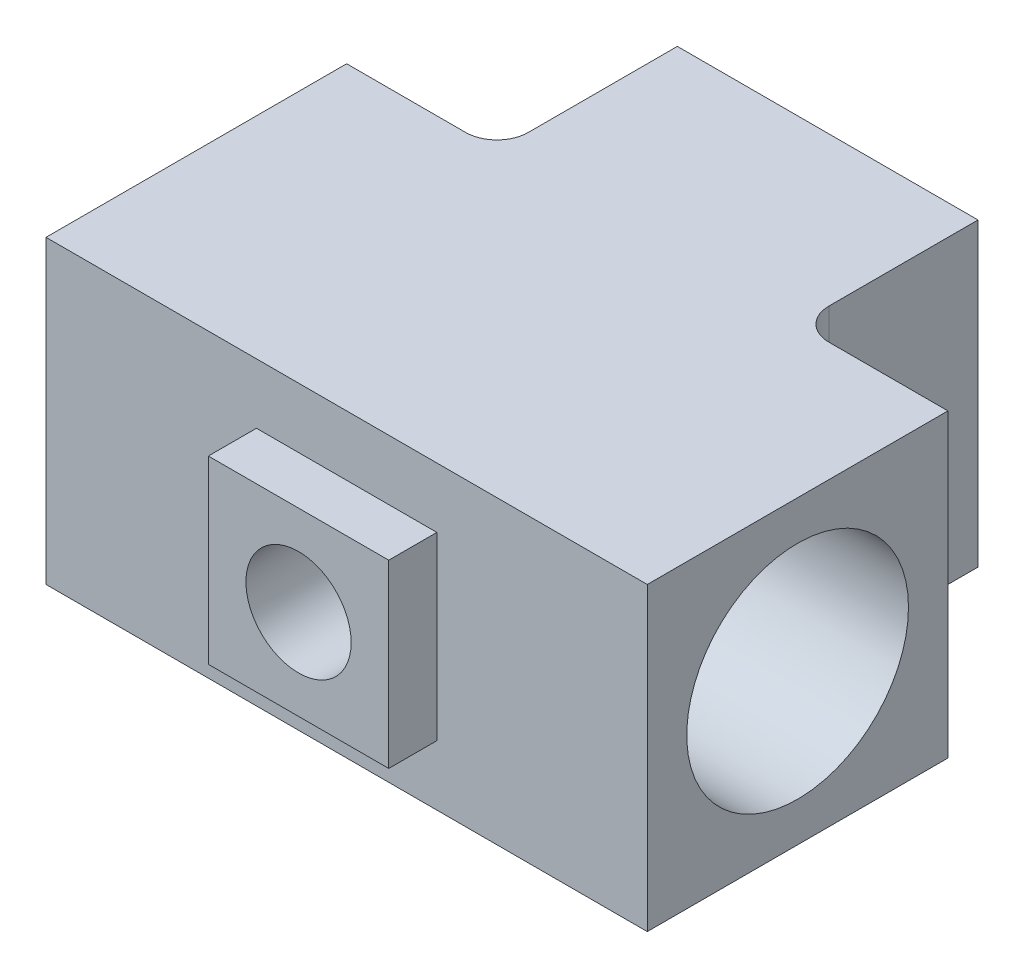
ISO-10303-21;
HEADER;
FILE_DESCRIPTION(('STEP AP214'),'2;1');
FILE_NAME('part.step','',(''),(''),'','','');
FILE_SCHEMA(('AUTOMOTIVE_DESIGN { 1 0 10303 214 1 1 1 1 }'));
ENDSEC;
DATA;
#1=APPLICATION_CONTEXT('core data for automotive mechanical design processes');
#2=APPLICATION_PROTOCOL_DEFINITION('international standard','automotive_design',2000,#1);
#3=PRODUCT_CONTEXT('',#1,'mechanical');
#4=PRODUCT('Part','Part','',(#3));
#5=PRODUCT_RELATED_PRODUCT_CATEGORY('part','',(#4));
#6=PRODUCT_DEFINITION_FORMATION('','',#4);
#7=PRODUCT_DEFINITION_CONTEXT('part definition',#1,'design');
#8=PRODUCT_DEFINITION('design','',#6,#7);
#9=PRODUCT_DEFINITION_SHAPE('','',#8);
#10=(LENGTH_UNIT() NAMED_UNIT(*) SI_UNIT(.MILLI.,.METRE.));
#11=(NAMED_UNIT(*) PLANE_ANGLE_UNIT() SI_UNIT($,.RADIAN.));
#12=(NAMED_UNIT(*) SI_UNIT($,.STERADIAN.) SOLID_ANGLE_UNIT());
#13=UNCERTAINTY_MEASURE_WITH_UNIT(LENGTH_MEASURE(1.E-05),#10,'distance_accuracy_value','');
#14=(GEOMETRIC_REPRESENTATION_CONTEXT(3) GLOBAL_UNCERTAINTY_ASSIGNED_CONTEXT((#13)) GLOBAL_UNIT_ASSIGNED_CONTEXT((#10,
#11,#12)) REPRESENTATION_CONTEXT('',''));
#15=CARTESIAN_POINT('',(0.,0.,0.));
#16=DIRECTION('',(0.,0.,1.));
#17=DIRECTION('',(1.,0.,0.));
#18=AXIS2_PLACEMENT_3D('',#15,#16,#17);
#19=CARTESIAN_POINT('',(0.,31.75,15.875));
#20=DIRECTION('',(0.,0.,-1.));
#21=DIRECTION('',(-1.,0.,0.));
#22=AXIS2_PLACEMENT_3D('',#19,#20,#21);
#23=PLANE('',#22);
#24=DIRECTION('',(1.,0.,0.));
#25=VECTOR('',#24,1.);
#26=CARTESIAN_POINT('',(0.,0.,15.875));
#27=LINE('',#26,#25);
#28=CARTESIAN_POINT('',(-31.75,0.,15.875));
#29=VERTEX_POINT('',#28);
#30=CARTESIAN_POINT('',(31.75,0.,15.875));
#31=VERTEX_POINT('',#30);
#32=EDGE_CURVE('E206',#29,#31,#27,.T.);
#33=ORIENTED_EDGE('',*,*,#32,.T.);
#34=DIRECTION('',(0.,-1.,0.));
#35=VECTOR('',#34,1.);
#36=CARTESIAN_POINT('',(31.75,31.75,15.875));
#37=LINE('',#36,#35);
#38=CARTESIAN_POINT('',(31.75,31.75,15.875));
#39=VERTEX_POINT('',#38);
#40=EDGE_CURVE('E276',#39,#31,#37,.T.);
#41=ORIENTED_EDGE('',*,*,#40,.F.);
#42=DIRECTION('',(1.,0.,0.));
#43=VECTOR('',#42,1.);
#44=CARTESIAN_POINT('',(0.,31.75,15.875));
#45=LINE('',#44,#43);
#46=CARTESIAN_POINT('',(-31.75,31.75,15.875));
#47=VERTEX_POINT('',#46);
#48=EDGE_CURVE('E207',#47,#39,#45,.T.);
#49=ORIENTED_EDGE('',*,*,#48,.F.);
#50=DIRECTION('',(0.,-1.,0.));
#51=VECTOR('',#50,1.);
#52=CARTESIAN_POINT('',(-31.75,31.75,15.875));
#53=LINE('',#52,#51);
#54=EDGE_CURVE('E234',#47,#29,#53,.T.);
#55=ORIENTED_EDGE('',*,*,#54,.T.);
#56=EDGE_LOOP('',(#33,#41,#49,#55));
#57=FACE_BOUND('',#56,.T.);
#58=DIRECTION('',(1.,0.,0.));
#59=VECTOR('',#58,1.);
#60=CARTESIAN_POINT('',(0.,6.35,15.875));
#61=LINE('',#60,#59);
#62=CARTESIAN_POINT('',(-9.525,6.35,15.875));
#63=VERTEX_POINT('',#62);
#64=CARTESIAN_POINT('',(9.525,6.35,15.875));
#65=VERTEX_POINT('',#64);
#66=EDGE_CURVE('E182',#63,#65,#61,.T.);
#67=ORIENTED_EDGE('',*,*,#66,.F.);
#68=DIRECTION('',(0.,1.,0.));
#69=VECTOR('',#68,1.);
#70=CARTESIAN_POINT('',(-9.525,0.,15.875));
#71=LINE('',#70,#69);
#72=CARTESIAN_POINT('',(-9.525,25.4,15.875));
#73=VERTEX_POINT('',#72);
#74=EDGE_CURVE('E179',#63,#73,#71,.T.);
#75=ORIENTED_EDGE('',*,*,#74,.T.);
#76=DIRECTION('',(1.,0.,0.));
#77=VECTOR('',#76,1.);
#78=CARTESIAN_POINT('',(0.,25.4,15.875));
#79=LINE('',#78,#77);
#80=CARTESIAN_POINT('',(9.525,25.4,15.875));
#81=VERTEX_POINT('',#80);
#82=EDGE_CURVE('E603',#73,#81,#79,.T.);
#83=ORIENTED_EDGE('',*,*,#82,.T.);
#84=DIRECTION('',(0.,1.,0.));
#85=VECTOR('',#84,1.);
#86=CARTESIAN_POINT('',(9.525,0.,15.875));
#87=LINE('',#86,#85);
#88=EDGE_CURVE('E595',#65,#81,#87,.T.);
#89=ORIENTED_EDGE('',*,*,#88,.F.);
#90=EDGE_LOOP('',(#67,#75,#83,#89));
#91=FACE_BOUND('',#90,.T.);
#92=ADVANCED_FACE('F43',(#57,#91),#23,.F.);
#93=CARTESIAN_POINT('',(31.75,31.75,0.));
#94=DIRECTION('',(-1.,0.,0.));
#95=DIRECTION('',(0.,0.,1.));
#96=AXIS2_PLACEMENT_3D('',#93,#94,#95);
#97=PLANE('',#96);
#98=CARTESIAN_POINT('',(31.75,15.875,0.));
#99=DIRECTION('',(1.,0.,0.));
#100=DIRECTION('',(0.,0.,-1.));
#101=AXIS2_PLACEMENT_3D('',#98,#99,#100);
#102=CIRCLE('',#101,11.707876);
#103=CARTESIAN_POINT('',(31.75,15.875,-11.707876));
#104=VERTEX_POINT('',#103);
#105=EDGE_CURVE('E198',#104,#104,#102,.T.);
#106=ORIENTED_EDGE('',*,*,#105,.F.);
#107=EDGE_LOOP('',(#106));
#108=FACE_BOUND('',#107,.T.);
#109=DIRECTION('',(0.,0.,-1.));
#110=VECTOR('',#109,1.);
#111=CARTESIAN_POINT('',(31.75,0.,0.));
#112=LINE('',#111,#110);
#113=CARTESIAN_POINT('',(31.75,0.,-15.875));
#114=VERTEX_POINT('',#113);
#115=EDGE_CURVE('E238',#31,#114,#112,.T.);
#116=ORIENTED_EDGE('',*,*,#115,.T.);
#117=DIRECTION('',(0.,-1.,0.));
#118=VECTOR('',#117,1.);
#119=CARTESIAN_POINT('',(31.75,31.75,-15.875));
#120=LINE('',#119,#118);
#121=CARTESIAN_POINT('',(31.75,31.75,-15.875));
#122=VERTEX_POINT('',#121);
#123=EDGE_CURVE('E272',#122,#114,#120,.T.);
#124=ORIENTED_EDGE('',*,*,#123,.F.);
#125=DIRECTION('',(0.,0.,-1.));
#126=VECTOR('',#125,1.);
#127=CARTESIAN_POINT('',(31.75,31.75,0.));
#128=LINE('',#127,#126);
#129=EDGE_CURVE('E211',#39,#122,#128,.T.);
#130=ORIENTED_EDGE('',*,*,#129,.F.);
#131=ORIENTED_EDGE('',*,*,#40,.T.);
#132=EDGE_LOOP('',(#116,#124,#130,#131));
#133=FACE_BOUND('',#132,.T.);
#134=ADVANCED_FACE('F349',(#108,#133),#97,.F.);
#135=CARTESIAN_POINT('',(0.,31.75,-15.875));
#136=DIRECTION('',(0.,0.,-1.));
#137=DIRECTION('',(-1.,0.,0.));
#138=AXIS2_PLACEMENT_3D('',#135,#136,#137);
#139=PLANE('',#138);
#140=DIRECTION('',(1.,0.,0.));
#141=VECTOR('',#140,1.);
#142=CARTESIAN_POINT('',(0.,0.,-15.875));
#143=LINE('',#142,#141);
#144=CARTESIAN_POINT('',(19.177,0.,-15.875));
#145=VERTEX_POINT('',#144);
#146=EDGE_CURVE('E242',#145,#114,#143,.T.);
#147=ORIENTED_EDGE('',*,*,#146,.F.);
#148=DIRECTION('',(0.,-1.,0.));
#149=VECTOR('',#148,1.);
#150=CARTESIAN_POINT('',(19.177,31.75,-15.875));
#151=LINE('',#150,#149);
#152=CARTESIAN_POINT('',(19.177,31.75,-15.875));
#153=VERTEX_POINT('',#152);
#154=EDGE_CURVE('E370',#145,#153,#151,.F.);
#155=ORIENTED_EDGE('',*,*,#154,.T.);
#156=DIRECTION('',(1.,0.,0.));
#157=VECTOR('',#156,1.);
#158=CARTESIAN_POINT('',(0.,31.75,-15.875));
#159=LINE('',#158,#157);
#160=EDGE_CURVE('E216',#153,#122,#159,.T.);
#161=ORIENTED_EDGE('',*,*,#160,.T.);
#162=ORIENTED_EDGE('',*,*,#123,.T.);
#163=EDGE_LOOP('',(#147,#155,#161,#162));
#164=FACE_BOUND('',#163,.T.);
#165=ADVANCED_FACE('F355',(#164),#139,.T.);
#166=CARTESIAN_POINT('',(15.875,31.75,0.));
#167=DIRECTION('',(-1.,0.,0.));
#168=DIRECTION('',(0.,0.,1.));
#169=AXIS2_PLACEMENT_3D('',#166,#167,#168);
#170=PLANE('',#169);
#171=DIRECTION('',(0.,0.,-1.));
#172=VECTOR('',#171,1.);
#173=CARTESIAN_POINT('',(15.875,31.75,0.));
#174=LINE('',#173,#172);
#175=CARTESIAN_POINT('',(15.875,31.75,-19.177));
#176=VERTEX_POINT('',#175);
#177=CARTESIAN_POINT('',(15.875,31.75,-34.925));
#178=VERTEX_POINT('',#177);
#179=EDGE_CURVE('E219',#176,#178,#174,.T.);
#180=ORIENTED_EDGE('',*,*,#179,.F.);
#181=DIRECTION('',(0.,-1.,0.));
#182=VECTOR('',#181,1.);
#183=CARTESIAN_POINT('',(15.875,31.75,-19.177));
#184=LINE('',#183,#182);
#185=CARTESIAN_POINT('',(15.875,0.,-19.177));
#186=VERTEX_POINT('',#185);
#187=EDGE_CURVE('E313',#176,#186,#184,.T.);
#188=ORIENTED_EDGE('',*,*,#187,.T.);
#189=DIRECTION('',(0.,0.,-1.));
#190=VECTOR('',#189,1.);
#191=CARTESIAN_POINT('',(15.875,0.,0.));
#192=LINE('',#191,#190);
#193=CARTESIAN_POINT('',(15.875,0.,-34.925));
#194=VERTEX_POINT('',#193);
#195=EDGE_CURVE('E245',#186,#194,#192,.T.);
#196=ORIENTED_EDGE('',*,*,#195,.T.);
#197=DIRECTION('',(0.,-1.,0.));
#198=VECTOR('',#197,1.);
#199=CARTESIAN_POINT('',(15.875,31.75,-34.925));
#200=LINE('',#199,#198);
#201=EDGE_CURVE('E268',#178,#194,#200,.T.);
#202=ORIENTED_EDGE('',*,*,#201,.F.);
#203=EDGE_LOOP('',(#180,#188,#196,#202));
#204=FACE_BOUND('',#203,.T.);
#205=ADVANCED_FACE('F393',(#204),#170,.F.);
#206=CARTESIAN_POINT('',(0.,31.75,-34.925));
#207=DIRECTION('',(0.,0.,-1.));
#208=DIRECTION('',(-1.,0.,0.));
#209=AXIS2_PLACEMENT_3D('',#206,#207,#208);
#210=PLANE('',#209);
#211=CARTESIAN_POINT('',(0.,15.875,-34.925));
#212=DIRECTION('',(0.,0.,-1.));
#213=DIRECTION('',(-1.,0.,0.));
#214=AXIS2_PLACEMENT_3D('',#211,#212,#213);
#215=CIRCLE('',#214,11.707876);
#216=CARTESIAN_POINT('',(-11.707876,15.875,-34.925));
#217=VERTEX_POINT('',#216);
#218=EDGE_CURVE('E184',#217,#217,#215,.T.);
#219=ORIENTED_EDGE('',*,*,#218,.F.);
#220=EDGE_LOOP('',(#219));
#221=FACE_BOUND('',#220,.T.);
#222=DIRECTION('',(1.,0.,0.));
#223=VECTOR('',#222,1.);
#224=CARTESIAN_POINT('',(0.,0.,-34.925));
#225=LINE('',#224,#223);
#226=CARTESIAN_POINT('',(-15.875,0.,-34.925));
#227=VERTEX_POINT('',#226);
#228=EDGE_CURVE('E249',#227,#194,#225,.T.);
#229=ORIENTED_EDGE('',*,*,#228,.F.);
#230=DIRECTION('',(0.,-1.,0.));
#231=VECTOR('',#230,1.);
#232=CARTESIAN_POINT('',(-15.875,31.75,-34.925));
#233=LINE('',#232,#231);
#234=CARTESIAN_POINT('',(-15.875,31.75,-34.925));
#235=VERTEX_POINT('',#234);
#236=EDGE_CURVE('E264',#235,#227,#233,.T.);
#237=ORIENTED_EDGE('',*,*,#236,.F.);
#238=DIRECTION('',(1.,0.,0.));
#239=VECTOR('',#238,1.);
#240=CARTESIAN_POINT('',(0.,31.75,-34.925));
#241=LINE('',#240,#239);
#242=EDGE_CURVE('E223',#235,#178,#241,.T.);
#243=ORIENTED_EDGE('',*,*,#242,.T.);
#244=ORIENTED_EDGE('',*,*,#201,.T.);
#245=EDGE_LOOP('',(#229,#237,#243,#244));
#246=FACE_BOUND('',#245,.T.);
#247=ADVANCED_FACE('F400',(#221,#246),#210,.T.);
#248=CARTESIAN_POINT('',(-15.875,31.75,0.));
#249=DIRECTION('',(-1.,0.,0.));
#250=DIRECTION('',(0.,0.,1.));
#251=AXIS2_PLACEMENT_3D('',#248,#249,#250);
#252=PLANE('',#251);
#253=DIRECTION('',(0.,0.,-1.));
#254=VECTOR('',#253,1.);
#255=CARTESIAN_POINT('',(-15.875,0.,0.));
#256=LINE('',#255,#254);
#257=CARTESIAN_POINT('',(-15.875,0.,-19.177));
#258=VERTEX_POINT('',#257);
#259=EDGE_CURVE('E253',#258,#227,#256,.T.);
#260=ORIENTED_EDGE('',*,*,#259,.F.);
#261=DIRECTION('',(0.,-1.,0.));
#262=VECTOR('',#261,1.);
#263=CARTESIAN_POINT('',(-15.875,31.75,-19.177));
#264=LINE('',#263,#262);
#265=CARTESIAN_POINT('',(-15.875,31.75,-19.177));
#266=VERTEX_POINT('',#265);
#267=EDGE_CURVE('E59',#258,#266,#264,.F.);
#268=ORIENTED_EDGE('',*,*,#267,.T.);
#269=DIRECTION('',(0.,0.,-1.));
#270=VECTOR('',#269,1.);
#271=CARTESIAN_POINT('',(-15.875,31.75,0.));
#272=LINE('',#271,#270);
#273=EDGE_CURVE('E227',#266,#235,#272,.T.);
#274=ORIENTED_EDGE('',*,*,#273,.T.);
#275=ORIENTED_EDGE('',*,*,#236,.T.);
#276=EDGE_LOOP('',(#260,#268,#274,#275));
#277=FACE_BOUND('',#276,.T.);
#278=ADVANCED_FACE('F434',(#277),#252,.T.);
#279=CARTESIAN_POINT('',(-31.75,31.75,-15.875));
#280=VERTEX_POINT('',#279);
#281=CARTESIAN_POINT('',(-19.177,31.75,-15.875));
#282=VERTEX_POINT('',#281);
#283=EDGE_CURVE('E220',#280,#282,#159,.T.);
#284=ORIENTED_EDGE('',*,*,#283,.T.);
#285=DIRECTION('',(0.,-1.,0.));
#286=VECTOR('',#285,1.);
#287=CARTESIAN_POINT('',(-19.177,0.,-15.875));
#288=LINE('',#287,#286);
#289=CARTESIAN_POINT('',(-19.177,0.,-15.875));
#290=VERTEX_POINT('',#289);
#291=EDGE_CURVE('E384',#282,#290,#288,.T.);
#292=ORIENTED_EDGE('',*,*,#291,.T.);
#293=CARTESIAN_POINT('',(-31.75,0.,-15.875));
#294=VERTEX_POINT('',#293);
#295=EDGE_CURVE('E246',#294,#290,#143,.T.);
#296=ORIENTED_EDGE('',*,*,#295,.F.);
#297=DIRECTION('',(0.,-1.,0.));
#298=VECTOR('',#297,1.);
#299=CARTESIAN_POINT('',(-31.75,31.75,-15.875));
#300=LINE('',#299,#298);
#301=EDGE_CURVE('E261',#280,#294,#300,.T.);
#302=ORIENTED_EDGE('',*,*,#301,.F.);
#303=EDGE_LOOP('',(#284,#292,#296,#302));
#304=FACE_BOUND('',#303,.T.);
#305=ADVANCED_FACE('F409',(#304),#139,.T.);
#306=CARTESIAN_POINT('',(-31.75,31.75,0.));
#307=DIRECTION('',(-1.,0.,0.));
#308=DIRECTION('',(0.,0.,1.));
#309=AXIS2_PLACEMENT_3D('',#306,#307,#308);
#310=PLANE('',#309);
#311=CARTESIAN_POINT('',(-31.75,15.875,0.));
#312=DIRECTION('',(1.,0.,0.));
#313=DIRECTION('',(0.,0.,-1.));
#314=AXIS2_PLACEMENT_3D('',#311,#312,#313);
#315=CIRCLE('',#314,11.707876);
#316=CARTESIAN_POINT('',(-31.75,15.875,-11.707876));
#317=VERTEX_POINT('',#316);
#318=EDGE_CURVE('E202',#317,#317,#315,.T.);
#319=ORIENTED_EDGE('',*,*,#318,.T.);
#320=EDGE_LOOP('',(#319));
#321=FACE_BOUND('',#320,.T.);
#322=DIRECTION('',(0.,0.,-1.));
#323=VECTOR('',#322,1.);
#324=CARTESIAN_POINT('',(-31.75,0.,0.));
#325=LINE('',#324,#323);
#326=EDGE_CURVE('E212',#29,#294,#325,.T.);
#327=ORIENTED_EDGE('',*,*,#326,.F.);
#328=ORIENTED_EDGE('',*,*,#54,.F.);
#329=DIRECTION('',(0.,0.,-1.));
#330=VECTOR('',#329,1.);
#331=CARTESIAN_POINT('',(-31.75,31.75,0.));
#332=LINE('',#331,#330);
#333=EDGE_CURVE('E230',#47,#280,#332,.T.);
#334=ORIENTED_EDGE('',*,*,#333,.T.);
#335=ORIENTED_EDGE('',*,*,#301,.T.);
#336=EDGE_LOOP('',(#327,#328,#334,#335));
#337=FACE_BOUND('',#336,.T.);
#338=ADVANCED_FACE('F444',(#321,#337),#310,.T.);
#339=CARTESIAN_POINT('',(0.,31.75,0.));
#340=DIRECTION('',(0.,1.,0.));
#341=DIRECTION('',(0.,0.,1.));
#342=AXIS2_PLACEMENT_3D('',#339,#340,#341);
#343=PLANE('',#342);
#344=ORIENTED_EDGE('',*,*,#48,.T.);
#345=ORIENTED_EDGE('',*,*,#129,.T.);
#346=ORIENTED_EDGE('',*,*,#160,.F.);
#347=CARTESIAN_POINT('',(19.177,31.75,-19.177));
#348=DIRECTION('',(0.,1.,0.));
#349=DIRECTION('',(0.,0.,1.));
#350=AXIS2_PLACEMENT_3D('',#347,#348,#349);
#351=CIRCLE('',#350,3.302);
#352=EDGE_CURVE('E369',#153,#176,#351,.F.);
#353=ORIENTED_EDGE('',*,*,#352,.T.);
#354=ORIENTED_EDGE('',*,*,#179,.T.);
#355=ORIENTED_EDGE('',*,*,#242,.F.);
#356=ORIENTED_EDGE('',*,*,#273,.F.);
#357=CARTESIAN_POINT('',(-19.177,31.75,-19.177));
#358=DIRECTION('',(0.,1.,0.));
#359=DIRECTION('',(0.,0.,1.));
#360=AXIS2_PLACEMENT_3D('',#357,#358,#359);
#361=CIRCLE('',#360,3.302);
#362=EDGE_CURVE('E11',#266,#282,#361,.F.);
#363=ORIENTED_EDGE('',*,*,#362,.T.);
#364=ORIENTED_EDGE('',*,*,#283,.F.);
#365=ORIENTED_EDGE('',*,*,#333,.F.);
#366=EDGE_LOOP('',(#344,#345,#346,#353,#354,#355,#356,#363,#364,#365));
#367=FACE_BOUND('',#366,.T.);
#368=ADVANCED_FACE('F402',(#367),#343,.T.);
#369=CARTESIAN_POINT('',(0.,0.,0.));
#370=DIRECTION('',(0.,1.,0.));
#371=DIRECTION('',(0.,0.,1.));
#372=AXIS2_PLACEMENT_3D('',#369,#370,#371);
#373=PLANE('',#372);
#374=ORIENTED_EDGE('',*,*,#32,.F.);
#375=ORIENTED_EDGE('',*,*,#326,.T.);
#376=ORIENTED_EDGE('',*,*,#295,.T.);
#377=CARTESIAN_POINT('',(-19.177,0.,-19.177));
#378=DIRECTION('',(0.,1.,0.));
#379=DIRECTION('',(0.,0.,1.));
#380=AXIS2_PLACEMENT_3D('',#377,#378,#379);
#381=CIRCLE('',#380,3.302);
#382=EDGE_CURVE('E52',#290,#258,#381,.T.);
#383=ORIENTED_EDGE('',*,*,#382,.T.);
#384=ORIENTED_EDGE('',*,*,#259,.T.);
#385=ORIENTED_EDGE('',*,*,#228,.T.);
#386=ORIENTED_EDGE('',*,*,#195,.F.);
#387=CARTESIAN_POINT('',(19.177,0.,-19.177));
#388=DIRECTION('',(0.,1.,0.));
#389=DIRECTION('',(0.,0.,1.));
#390=AXIS2_PLACEMENT_3D('',#387,#388,#389);
#391=CIRCLE('',#390,3.302);
#392=EDGE_CURVE('E376',#186,#145,#391,.T.);
#393=ORIENTED_EDGE('',*,*,#392,.T.);
#394=ORIENTED_EDGE('',*,*,#146,.T.);
#395=ORIENTED_EDGE('',*,*,#115,.F.);
#396=EDGE_LOOP('',(#374,#375,#376,#383,#384,#385,#386,#393,#394,#395));
#397=FACE_BOUND('',#396,.T.);
#398=ADVANCED_FACE('F396',(#397),#373,.F.);
#399=CARTESIAN_POINT('',(31.75,15.875,0.));
#400=DIRECTION('',(1.,0.,0.));
#401=DIRECTION('',(0.,0.,-1.));
#402=AXIS2_PLACEMENT_3D('',#399,#400,#401);
#403=CYLINDRICAL_SURFACE('',#402,11.707876);
#404=CARTESIAN_POINT('',(5.55625,15.875,11.707876));
#405=CARTESIAN_POINT('',(5.5562490670547,16.0219956300197,11.7078751881534));
#406=CARTESIAN_POINT('',(5.55040944138286,16.1690144828683,11.7051007412646));
#407=CARTESIAN_POINT('',(5.52711300941749,16.461980757862,11.6940720886933));
#408=CARTESIAN_POINT('',(5.5096503982511,16.6079276077738,11.6858151448901));
#409=CARTESIAN_POINT('',(5.46326853428186,16.8978361602466,11.6640185894263));
#410=CARTESIAN_POINT('',(5.43433046697483,17.0417941989339,11.6504703029361));
#411=CARTESIAN_POINT('',(5.36530691071274,17.3265046320242,11.6184349778542));
#412=CARTESIAN_POINT('',(5.3252168641208,17.4672556902865,11.5999459201696));
#413=CARTESIAN_POINT('',(5.23449222101402,17.7439869649946,11.558578243056));
#414=CARTESIAN_POINT('',(5.18390260396629,17.8799847312361,11.5357183797388));
#415=CARTESIAN_POINT('',(5.07254787724768,18.1470328976869,11.4861095658599));
#416=CARTESIAN_POINT('',(5.01177894652446,18.2780814173543,11.4593591553855));
#417=CARTESIAN_POINT('',(4.81500573588385,18.6625356387209,11.374210817044));
#418=CARTESIAN_POINT('',(4.66442750006194,18.9075748322604,11.3108650175544));
#419=CARTESIAN_POINT('',(4.31931225020357,19.3830943690822,11.172846650347));
#420=CARTESIAN_POINT('',(4.12278313903047,19.6119869093358,11.0977380273396));
#421=CARTESIAN_POINT('',(3.69536606488713,20.0351137703647,10.9461555166101));
#422=CARTESIAN_POINT('',(3.46445486769873,20.2293244576388,10.8696807366803));
#423=CARTESIAN_POINT('',(3.08761306739184,20.4971802127023,10.7573275120701));
#424=CARTESIAN_POINT('',(2.95214301803387,20.5848729763442,10.7191187675812));
#425=CARTESIAN_POINT('',(2.67348841892434,20.7484420665901,10.6457475911625));
#426=CARTESIAN_POINT('',(2.53030715440833,20.8243233725001,10.6105838783407));
#427=CARTESIAN_POINT('',(2.23705973706034,20.9635981838658,10.5444999682807));
#428=CARTESIAN_POINT('',(2.08699382639768,21.0269921281533,10.5135796219335));
#429=CARTESIAN_POINT('',(1.78104248589405,21.1405868303316,10.4571497495938));
#430=CARTESIAN_POINT('',(1.62516040846482,21.190795058236,10.4316371615681));
#431=CARTESIAN_POINT('',(1.31763187169123,21.2749744066381,10.3882988077653));
#432=CARTESIAN_POINT('',(1.16624211207503,21.3097013787946,10.3701207556261));
#433=CARTESIAN_POINT('',(0.860534032998205,21.366406561334,10.3402053407049));
#434=CARTESIAN_POINT('',(0.706217237467131,21.3883912273824,10.3284647166761));
#435=CARTESIAN_POINT('',(0.395983551960721,21.4193124074155,10.3118994285777));
#436=CARTESIAN_POINT('',(0.240067452818413,21.4282550842524,10.3070714980085));
#437=CARTESIAN_POINT('',(-0.0720160121535494,21.4329741440577,10.3045278279577));
#438=CARTESIAN_POINT('',(-0.228183356988383,21.4287515752965,10.3068115222195));
#439=CARTESIAN_POINT('',(-0.522928915415686,21.408347008689,10.3177779419443));
#440=CARTESIAN_POINT('',(-0.661626198136956,21.3934723912927,10.3257608677416));
#441=CARTESIAN_POINT('',(-0.937151103292585,21.3534165957299,10.3470685065718));
#442=CARTESIAN_POINT('',(-1.07397811602019,21.3282321356429,10.3603949205636));
#443=CARTESIAN_POINT('',(-1.34479800167592,21.2678352781495,10.3919606898642));
#444=CARTESIAN_POINT('',(-1.47879133751689,21.2326245324577,10.4101992359292));
#445=CARTESIAN_POINT('',(-1.74319244552311,21.1525283471567,10.451031910625));
#446=CARTESIAN_POINT('',(-1.87359879519847,21.1076391299959,10.4736277395583));
#447=CARTESIAN_POINT('',(-2.26419153088437,20.9567618925136,10.5481218915923));
#448=CARTESIAN_POINT('',(-2.51768397132441,20.8359244835259,10.6059777720465));
#449=CARTESIAN_POINT('',(-3.00181689912236,20.5589065955817,10.7311887482533));
#450=CARTESIAN_POINT('',(-3.23244723761796,20.4027105204648,10.7985480308548));
#451=CARTESIAN_POINT('',(-3.69183766517802,20.0388318111672,10.9443811212133));
#452=CARTESIAN_POINT('',(-3.91745591328223,19.8273300013133,11.0232518530874));
#453=CARTESIAN_POINT('',(-4.33132042570187,19.3688331100084,11.1770205898922));
#454=CARTESIAN_POINT('',(-4.51955208699981,19.121824224347,11.2519170341479));
#455=CARTESIAN_POINT('',(-4.77304693768573,18.7238633432388,11.3568591982738));
#456=CARTESIAN_POINT('',(-4.85394463688191,18.5837680812418,11.3911669215658));
#457=CARTESIAN_POINT('',(-5.00352831891484,18.2963277467566,11.4557050429006));
#458=CARTESIAN_POINT('',(-5.07221939836861,18.1489857329613,11.4859371413561));
#459=CARTESIAN_POINT('',(-5.19666325541256,17.8480962418706,11.5414321496642));
#460=CARTESIAN_POINT('',(-5.2524205517506,17.6945509539284,11.5666967945522));
#461=CARTESIAN_POINT('',(-5.35037081659372,17.3823802824512,11.6115035298262));
#462=CARTESIAN_POINT('',(-5.39256517116058,17.2237554198453,11.6310462049495));
#463=CARTESIAN_POINT('',(-5.46012906456972,16.915144658783,11.662531266347));
#464=CARTESIAN_POINT('',(-5.48654457741583,16.7654350163584,11.6749432879645));
#465=CARTESIAN_POINT('',(-5.52703502689974,16.4639974931509,11.6940259057448));
#466=CARTESIAN_POINT('',(-5.5411109121972,16.312269768427,11.7006969432686));
#467=CARTESIAN_POINT('',(-5.55674296594966,16.0080771010916,11.7081079424604));
#468=CARTESIAN_POINT('',(-5.55830329883384,15.8556124205924,11.7088498769798));
#469=CARTESIAN_POINT('',(-5.54889489263416,15.5511608531681,11.704386489232));
#470=CARTESIAN_POINT('',(-5.53792660674304,15.39917394916,11.6991813820847));
#471=CARTESIAN_POINT('',(-5.50478017063363,15.1072862469522,11.6835292579519));
#472=CARTESIAN_POINT('',(-5.48342146609895,14.9672707825598,11.6734657841895));
#473=CARTESIAN_POINT('',(-5.43017825708567,14.6896460047093,11.6485505178758));
#474=CARTESIAN_POINT('',(-5.39829038796472,14.5520374752185,11.6336971947419));
#475=CARTESIAN_POINT('',(-5.32431618570488,14.2801954806572,11.599556499368));
#476=CARTESIAN_POINT('',(-5.28223290191295,14.1459610196616,11.5802704529996));
#477=CARTESIAN_POINT('',(-5.18825596784897,13.8816044140219,11.537707889774));
#478=CARTESIAN_POINT('',(-5.13635856579069,13.7514838643396,11.5144298471561));
#479=CARTESIAN_POINT('',(-4.96318183253331,13.3607701508536,11.4378578353452));
#480=CARTESIAN_POINT('',(-4.82661055341782,13.1078682024308,11.3788741108013));
#481=CARTESIAN_POINT('',(-4.5176744127763,12.6278159694376,11.251314731817));
#482=CARTESIAN_POINT('',(-4.34529386087363,12.4006770410001,11.1827348770003));
#483=CARTESIAN_POINT('',(-3.95157432883895,11.9567394277016,11.0354457403168));
#484=CARTESIAN_POINT('',(-3.7272193483145,11.7427284831527,10.9563810612571));
#485=CARTESIAN_POINT('',(-3.24503350656331,11.3542173570866,10.801883932444));
#486=CARTESIAN_POINT('',(-2.98718516943329,11.1797379333624,10.7264534072571));
#487=CARTESIAN_POINT('',(-2.57468424743307,10.9486385624648,10.6213394391657));
#488=CARTESIAN_POINT('',(-2.43010597934156,10.8757150807021,10.5871135962812));
#489=CARTESIAN_POINT('',(-2.13432111415372,10.7424705907097,10.5231630514126));
#490=CARTESIAN_POINT('',(-1.98311753499164,10.6821439151729,10.4934363269373));
#491=CARTESIAN_POINT('',(-1.67520723198086,10.5747957041115,10.4396266492068));
#492=CARTESIAN_POINT('',(-1.51850453154699,10.5277646599812,10.4155396647202));
#493=CARTESIAN_POINT('',(-1.200732092371,10.4475702205434,10.373977724913));
#494=CARTESIAN_POINT('',(-1.03966294810005,10.4144049474717,10.3565018743137));
#495=CARTESIAN_POINT('',(-0.729535200470578,10.3648238222407,10.3301998525504));
#496=CARTESIAN_POINT('',(-0.580731665939755,10.3471497022177,10.3207268309375));
#497=CARTESIAN_POINT('',(-0.281917477634769,10.3238840686606,10.3082321598221));
#498=CARTESIAN_POINT('',(-0.131906926340674,10.3182915399976,10.3052099683031));
#499=CARTESIAN_POINT('',(0.16802266851762,10.3192671483892,10.3057359057173));
#500=CARTESIAN_POINT('',(0.317941725698948,10.3258321539953,10.3092823427514));
#501=CARTESIAN_POINT('',(0.616463714308427,10.3510227316465,10.3228018711544));
#502=CARTESIAN_POINT('',(0.765066681619223,10.3696479738419,10.3327747867579));
#503=CARTESIAN_POINT('',(1.0482391987646,10.4167889819883,10.3577479846447));
#504=CARTESIAN_POINT('',(1.18299754518976,10.4444175866031,10.3722942303451));
#505=CARTESIAN_POINT('',(1.44956047189303,10.5094120483584,10.4060634326495));
#506=CARTESIAN_POINT('',(1.58136411000138,10.5467809647526,10.4252878584579));
#507=CARTESIAN_POINT('',(1.97114425759086,10.6729835373416,10.4891540771941));
#508=CARTESIAN_POINT('',(2.22367529552805,10.7759443673374,10.5400063688014));
#509=CARTESIAN_POINT('',(2.72507942902464,11.0242905995805,10.6566839522561));
#510=CARTESIAN_POINT('',(2.97258360902167,11.1720487713224,10.7232820243315));
#511=CARTESIAN_POINT('',(3.44084715370402,11.5029546897009,10.862404890388));
#512=CARTESIAN_POINT('',(3.66159354119899,11.6861194972581,10.9349325318095));
#513=CARTESIAN_POINT('',(4.09421770720619,12.1054936351878,11.0869196235712));
#514=CARTESIAN_POINT('',(4.30272081067078,12.3452558129597,11.1663058313705));
#515=CARTESIAN_POINT('',(4.58332952200995,12.7301105464011,11.2783877266976));
#516=CARTESIAN_POINT('',(4.67156770409046,12.8627174251822,11.3146091589742));
#517=CARTESIAN_POINT('',(4.83664890141032,13.1356329620851,11.3837601326838));
#518=CARTESIAN_POINT('',(4.91349716893065,13.2759380291523,11.4166911891251));
#519=CARTESIAN_POINT('',(5.05495058563346,13.5630838909267,11.4782806625807));
#520=CARTESIAN_POINT('',(5.11958252263107,13.7099094927594,11.5069483979916));
#521=CARTESIAN_POINT('',(5.23611941004082,14.0093221256557,11.5592681967573));
#522=CARTESIAN_POINT('',(5.28803056735213,14.1619063048039,11.5829227054707));
#523=CARTESIAN_POINT('',(5.37844577569775,14.4713744590327,11.624479196636));
#524=CARTESIAN_POINT('',(5.41698047331251,14.6282477051782,11.6423943211296));
#525=CARTESIAN_POINT('',(5.48028894861639,14.9452469709914,11.6719846398577));
#526=CARTESIAN_POINT('',(5.50507167626061,15.1053708046215,11.6836638922887));
#527=CARTESIAN_POINT('',(5.53394323457253,15.3673478595856,11.6973025382662));
#528=CARTESIAN_POINT('',(5.54230323419874,15.4686486587331,11.7012626723678));
#529=CARTESIAN_POINT('',(5.55345700273366,15.6716292615559,11.7065497139097));
#530=CARTESIAN_POINT('',(5.55625064540742,15.7733090737743,11.7078765616318));
#531=CARTESIAN_POINT('',(5.55625,15.875,11.707876));
#532=B_SPLINE_CURVE_WITH_KNOTS('',3,(#404,#405,#406,#407,#408,#409,#410,#411,#412,#413,#414,
#415,#416,#417,#418,#419,#420,#421,#422,#423,#424,#425,#426,#427,#428,#429,#430,#431,#432,#433,
#434,#435,#436,#437,#438,#439,#440,#441,#442,#443,#444,#445,#446,#447,#448,#449,#450,#451,#452,
#453,#454,#455,#456,#457,#458,#459,#460,#461,#462,#463,#464,#465,#466,#467,#468,#469,#470,#471,
#472,#473,#474,#475,#476,#477,#478,#479,#480,#481,#482,#483,#484,#485,#486,#487,#488,#489,#490,
#491,#492,#493,#494,#495,#496,#497,#498,#499,#500,#501,#502,#503,#504,#505,#506,#507,#508,#509,
#510,#511,#512,#513,#514,#515,#516,#517,#518,#519,#520,#521,#522,#523,#524,#525,#526,#527,#528,
#529,#530,#531),.UNSPECIFIED.,.T.,.F.,(4,2,2,2,2,2,2,2,2,2,2,2,2,2,2,2,2,2,2,2,2,2,2,2,2,2,2,2,
2,2,2,2,2,2,2,2,2,2,2,2,2,2,2,2,2,2,2,2,2,2,2,2,2,2,2,2,2,2,2,2,2,2,2,4),(0.,0.440885883860532,
0.881992124942835,1.32382458879489,1.76583788852136,2.20599533484612,2.64631837672899,
3.52593867536117,4.45490278042841,5.3844975203964,5.88148882338394,6.37827004109477,
6.87503379776749,7.37151551619725,7.84000556444114,8.30825805249056,8.77628920106892,
9.24428308405656,9.66295232634392,10.081754946899,10.5004886144467,10.9193860124707,
11.7757584217823,12.6325093022665,13.5858440188259,14.5395503741225,15.0351183045488,
15.5304788323557,16.0256660317504,16.5208026095,16.9777832881054,17.4347288313585,
17.8915223240861,18.3482992939276,18.7737833031537,19.1994034095245,19.6248963739772,
20.0505523278662,20.926784244243,21.8034009078341,22.7592085654323,23.7155169553753,
24.2114753538127,24.7072101373491,25.202589485286,25.697901725005,26.1477367393194,
26.5975339557755,27.0472153328768,27.4968844116227,27.9113955303841,28.326036996705,
29.1547601665215,30.0387912953419,30.9232494670413,31.9007316622217,32.3902826841781,
32.8796072502312,33.3678460571452,33.8558461593271,34.3427207169139,34.8292780376632,
35.1342740240184,35.4392769270546),.UNSPECIFIED.);
#533=CARTESIAN_POINT('',(5.55625,15.875,11.707876));
#534=VERTEX_POINT('',#533);
#535=EDGE_CURVE('E315',#534,#534,#532,.T.);
#536=ORIENTED_EDGE('',*,*,#535,.T.);
#537=EDGE_LOOP('',(#536));
#538=FACE_BOUND('',#537,.T.);
#539=CARTESIAN_POINT('',(0.,15.875,0.));
#540=DIRECTION('',(0.707106781186547,0.,0.707106781186548));
#541=DIRECTION('',(0.707106781186548,0.,-0.707106781186547));
#542=AXIS2_PLACEMENT_3D('',#539,#540,#541);
#543=ELLIPSE('',#542,16.5574370257825,11.707876);
#544=CARTESIAN_POINT('',(0.635000000000105,27.5656430717637,-0.635000000000011));
#545=VERTEX_POINT('',#544);
#546=CARTESIAN_POINT('',(0.635000000000105,4.18435692823634,-0.63500000000001));
#547=VERTEX_POINT('',#546);
#548=EDGE_CURVE('E290',#545,#547,#543,.F.);
#549=ORIENTED_EDGE('',*,*,#548,.T.);
#550=CARTESIAN_POINT('',(8.42254651235187,4.36956100535308,-2.16777166044622));
#551=CARTESIAN_POINT('',(8.18497624672468,4.35500262928698,-2.09051695589627));
#552=CARTESIAN_POINT('',(7.94676765423137,4.34158429303458,-2.01500617137517));
#553=CARTESIAN_POINT('',(7.46905507952934,4.31686263435833,-1.8679847421118));
#554=CARTESIAN_POINT('',(7.22955132119966,4.30555895771151,-1.79647342883447));
#555=CARTESIAN_POINT('',(6.50593370822799,4.2744359888127,-1.58779912659645));
#556=CARTESIAN_POINT('',(6.01969412523136,4.25758346099643,-1.45747843888541));
#557=CARTESIAN_POINT('',(4.95959627069673,4.22794979627484,-1.20004752034698));
#558=CARTESIAN_POINT('',(4.38466330035338,4.21631817787254,-1.0771060033455));
#559=CARTESIAN_POINT('',(3.51685228000186,4.20342933817754,-0.922749530027433));
#560=CARTESIAN_POINT('',(3.22665152405338,4.19989270072696,-0.876303617454054));
#561=CARTESIAN_POINT('',(2.64469408906931,4.19403812195733,-0.794466957671167));
#562=CARTESIAN_POINT('',(2.35293757509501,4.19172005385188,-0.759075060499087));
#563=CARTESIAN_POINT('',(1.76939809435973,4.18805304724045,-0.700355102378815));
#564=CARTESIAN_POINT('',(1.47762005982941,4.1867002060811,-0.676978568843169));
#565=CARTESIAN_POINT('',(0.893319696252306,4.18476566420734,-0.642712182249023));
#566=CARTESIAN_POINT('',(0.600797360658699,4.18418397029955,-0.631822439406717));
#567=CARTESIAN_POINT('',(0.0156089137887403,4.18370220763738,-0.622846814613571));
#568=CARTESIAN_POINT('',(-0.277057159644212,4.1838020094862,-0.624758502031504));
#569=CARTESIAN_POINT('',(-0.862004324106952,4.18469924539351,-0.641321343118199));
#570=CARTESIAN_POINT('',(-1.15428543641018,4.1854966391301,-0.655971760468169));
#571=CARTESIAN_POINT('',(-1.79011429658135,4.18812168340123,-0.701318883763351));
#572=CARTESIAN_POINT('',(-2.13349106301049,4.19010795909214,-0.734414958368698));
#573=CARTESIAN_POINT('',(-2.81825070836102,4.19555891555114,-0.816513581846514));
#574=CARTESIAN_POINT('',(-3.15963385867944,4.19902339009612,-0.865513911692636));
#575=CARTESIAN_POINT('',(-3.84082847170671,4.20790403418873,-0.977962265920227));
#576=CARTESIAN_POINT('',(-4.18063402211738,4.21332497205111,-1.04144544779265));
#577=CARTESIAN_POINT('',(-4.85757394210145,4.22663372901664,-1.18103433112334));
#578=CARTESIAN_POINT('',(-5.19470825783573,4.23452159771209,-1.25714028632074));
#579=CARTESIAN_POINT('',(-6.10006493360562,4.25983088660007,-1.47699732193233));
#580=CARTESIAN_POINT('',(-6.66573670019036,4.28006619519613,-1.6309504694838));
#581=CARTESIAN_POINT('',(-7.7896714832392,4.33155835227052,-1.96251904509084));
#582=CARTESIAN_POINT('',(-8.347931982135,4.36281885132369,-2.14014229847223));
#583=CARTESIAN_POINT('',(-9.45836792733577,4.43846744272356,-2.51324153326811));
#584=CARTESIAN_POINT('',(-10.0105341133861,4.48287324844435,-2.7087413562069));
#585=CARTESIAN_POINT('',(-11.1085740938359,4.58657071677938,-3.11275499301566));
#586=CARTESIAN_POINT('',(-11.6544486508123,4.64586055510115,-3.32126720964276));
#587=CARTESIAN_POINT('',(-12.740384691404,4.78094358996574,-3.7478464934643));
#588=CARTESIAN_POINT('',(-13.2804462164,4.85673666894679,-3.96591349258584));
#589=CARTESIAN_POINT('',(-14.3549244899006,5.0264109732745,-4.40894230953428));
#590=CARTESIAN_POINT('',(-14.8893408420867,5.12029345979891,-4.63390460717524));
#591=CARTESIAN_POINT('',(-15.9517269335001,5.32769514881917,-5.08832520050002));
#592=CARTESIAN_POINT('',(-16.4797030050657,5.44119305912204,-5.31777838437856));
#593=CARTESIAN_POINT('',(-17.529211611908,5.68974377760838,-5.77959409726879));
#594=CARTESIAN_POINT('',(-18.0507452330405,5.82479289848291,-6.01195612233557));
#595=CARTESIAN_POINT('',(-18.8267290557974,6.04496885801852,-6.36110710417474));
#596=CARTESIAN_POINT('',(-19.0839512421687,6.1211654038397,-6.47741478973911));
#597=CARTESIAN_POINT('',(-19.5964056687186,6.27979200861453,-6.71015483767589));
#598=CARTESIAN_POINT('',(-19.8516379741529,6.36222186219783,-6.82658719581618));
#599=CARTESIAN_POINT('',(-20.3596493735862,6.53357565439097,-7.0592505689825));
#600=CARTESIAN_POINT('',(-20.6124307989,6.62249255487304,-7.17548166617745));
#601=CARTESIAN_POINT('',(-21.1155885342822,6.80731833246786,-7.40766314526071));
#602=CARTESIAN_POINT('',(-21.3659645856111,6.90322795244541,-7.52361349596837));
#603=CARTESIAN_POINT('',(-21.6149968607117,7.00283469176638,-7.63930907705348));
#604=B_SPLINE_CURVE_WITH_KNOTS('',3,(#550,#551,#552,#553,#554,#555,#556,#557,#558,#559,#560,
#561,#562,#563,#564,#565,#566,#567,#568,#569,#570,#571,#572,#573,#574,#575,#576,#577,#578,#579,
#580,#581,#582,#583,#584,#585,#586,#587,#588,#589,#590,#591,#592,#593,#594,#595,#596,#597,#598,
#599,#600,#601,#602,#603),.UNSPECIFIED.,.F.,.F.,(4,2,2,2,2,2,2,2,2,2,2,2,2,2,2,2,2,2,2,2,2,2,2,
2,2,2,4),(0.,0.750708280709539,1.50129069876,3.01187908934912,4.77467283357672,5.65624120605746,
6.5377178373453,7.41560992498857,8.29350976139473,9.17124291406318,10.0489253357358,
11.0834283979348,12.1177871840627,13.1546841362531,14.1916019343565,15.9505391841596,
17.7100593871351,19.4719614304914,21.2336476279988,22.9953212764437,24.7571177917123,
26.5170137836933,28.2766089880978,29.1537433420948,30.0308488095055,30.9070164206286,
31.783277246576),.UNSPECIFIED.);
#605=CARTESIAN_POINT('',(-0.635000000000105,4.18435692823634,-0.635000000000011));
#606=VERTEX_POINT('',#605);
#607=EDGE_CURVE('E305',#547,#606,#604,.T.);
#608=ORIENTED_EDGE('',*,*,#607,.T.);
#609=CARTESIAN_POINT('',(0.,15.875,0.));
#610=DIRECTION('',(0.707106781186548,0.,-0.707106781186547));
#611=DIRECTION('',(0.707106781186547,0.,0.707106781186548));
#612=AXIS2_PLACEMENT_3D('',#609,#610,#611);
#613=ELLIPSE('',#612,16.5574370257825,11.707876);
#614=CARTESIAN_POINT('',(-0.635000000000105,27.5656430717637,-0.635000000000011));
#615=VERTEX_POINT('',#614);
#616=EDGE_CURVE('E314',#606,#615,#613,.T.);
#617=ORIENTED_EDGE('',*,*,#616,.T.);
#618=CARTESIAN_POINT('',(-21.6149968607117,24.7471653082336,-7.63930907705348));
#619=CARTESIAN_POINT('',(-21.343052388214,24.8559322381905,-7.51296947462934));
#620=CARTESIAN_POINT('',(-21.0695097836942,24.9602944564176,-7.38632729602658));
#621=CARTESIAN_POINT('',(-20.5195840957689,25.16072518573,-7.1327318687282));
#622=CARTESIAN_POINT('',(-20.2432013393858,25.2567946399526,-7.00577865709975));
#623=CARTESIAN_POINT('',(-19.6880348708734,25.4411316708936,-6.75189303089132));
#624=CARTESIAN_POINT('',(-19.4092524959533,25.5294033186335,-6.62496064040649));
#625=CARTESIAN_POINT('',(-18.849381034639,25.6986456689984,-6.37130995398182));
#626=CARTESIAN_POINT('',(-18.5682918736861,25.7796161346162,-6.24459166512297));
#627=CARTESIAN_POINT('',(-17.7219565094031,26.0121622805702,-5.86518120045383));
#628=CARTESIAN_POINT('',(-17.1535346762818,26.1534081092745,-5.61318402750243));
#629=CARTESIAN_POINT('',(-16.0093242971107,26.4110750447272,-5.1131728909606));
#630=CARTESIAN_POINT('',(-15.433534709877,26.5274926008349,-4.86515950176619));
#631=CARTESIAN_POINT('',(-14.2794660513051,26.7369934324876,-4.37736920148138));
#632=CARTESIAN_POINT('',(-13.7012372817636,26.8302436911438,-4.13754477728251));
#633=CARTESIAN_POINT('',(-12.5381504132782,26.9965473201778,-3.66711667421039));
#634=CARTESIAN_POINT('',(-11.9532921650518,27.0696002348077,-3.43651320350594));
#635=CARTESIAN_POINT('',(-10.7769932982763,27.1974445556236,-2.98844871733905));
#636=CARTESIAN_POINT('',(-10.1855568460874,27.2522469083545,-2.77097988813725));
#637=CARTESIAN_POINT('',(-8.99515092601248,27.3457481567211,-2.35411164934766));
#638=CARTESIAN_POINT('',(-8.39618315533811,27.3844506158237,-2.15470824890265));
#639=CARTESIAN_POINT('',(-7.6063271746617,27.4261917718516,-1.90992253484428));
#640=CARTESIAN_POINT('',(-7.41922531455408,27.4354040503336,-1.85325742033076));
#641=CARTESIAN_POINT('',(-7.04420604082747,27.452603618479,-1.74257946697964));
#642=CARTESIAN_POINT('',(-6.85628873382739,27.4605910636041,-1.68856629213796));
#643=CARTESIAN_POINT('',(-6.47925333105339,27.4754394501927,-1.583349164312));
#644=CARTESIAN_POINT('',(-6.29013367589407,27.4822983229758,-1.53215048218152));
#645=CARTESIAN_POINT('',(-5.91099110492879,27.4949625693504,-1.43294532948235));
#646=CARTESIAN_POINT('',(-5.7209680051788,27.500767718069,-1.38493954168423));
#647=CARTESIAN_POINT('',(-4.96025822408298,27.522029674052,-1.2001997667575));
#648=CARTESIAN_POINT('',(-4.3859024983356,27.5336562980263,-1.07736967417777));
#649=CARTESIAN_POINT('',(-3.51899998412952,27.5465423107661,-0.923110007442586));
#650=CARTESIAN_POINT('',(-3.22910076939516,27.5500788198011,-0.876683735039229));
#651=CARTESIAN_POINT('',(-2.64774741375955,27.5559349663146,-0.794860985661701));
#652=CARTESIAN_POINT('',(-2.35629345483044,27.5582547431779,-0.759463245484605));
#653=CARTESIAN_POINT('',(-1.77275454715281,27.5619299195562,-0.700643099994385));
#654=CARTESIAN_POINT('',(-1.48067201689336,27.5632872335957,-0.677196946947013));
#655=CARTESIAN_POINT('',(-0.895758112968711,27.5652286971099,-0.642816163020534));
#656=CARTESIAN_POINT('',(-0.602926730003146,27.5658128369351,-0.631881688293859));
#657=CARTESIAN_POINT('',(-0.0171254183703106,27.5662979751188,-0.622843659194518));
#658=CARTESIAN_POINT('',(0.275844467588858,27.5661991187326,-0.624737376600943));
#659=CARTESIAN_POINT('',(0.861398742493004,27.5653024121141,-0.641291021744902));
#660=CARTESIAN_POINT('',(1.15398315318333,27.5645046031644,-0.655950195510814));
#661=CARTESIAN_POINT('',(1.79026783871613,27.561877689401,-0.701329841655688));
#662=CARTESIAN_POINT('',(2.13379745698214,27.5598903052857,-0.734444566837807));
#663=CARTESIAN_POINT('',(2.81886728058173,27.554435475292,-0.816594646577824));
#664=CARTESIAN_POINT('',(3.16040772468115,27.5509682109204,-0.865628048540406));
#665=CARTESIAN_POINT('',(3.84160087893565,27.542084200685,-0.978103444539921));
#666=CARTESIAN_POINT('',(4.18124987308049,27.5366644615665,-1.04156750619861));
#667=CARTESIAN_POINT('',(4.85788585317578,27.5233585956719,-1.18110359082299));
#668=CARTESIAN_POINT('',(5.19487280988854,27.5154724418452,-1.25717575206488));
#669=CARTESIAN_POINT('',(5.77470680666415,27.4992655052414,-1.39799054550419));
#670=CARTESIAN_POINT('',(6.01820106434126,27.4916478306662,-1.46017752509333));
#671=CARTESIAN_POINT('',(6.50375106015159,27.4746357884823,-1.5896776591913));
#672=CARTESIAN_POINT('',(6.74580684429427,27.4652414780182,-1.65699064878344));
#673=CARTESIAN_POINT('',(7.22775525704048,27.4445237584495,-1.79593796356148));
#674=CARTESIAN_POINT('',(7.46765230920516,27.4332065550459,-1.86755792310905));
#675=CARTESIAN_POINT('',(7.94609654076017,27.4084538300882,-2.01479476529038));
#676=CARTESIAN_POINT('',(8.18464377876693,27.395018401262,-2.09041147286542));
#677=CARTESIAN_POINT('',(8.42254651235187,27.3804389946469,-2.16777166044622));
#678=B_SPLINE_CURVE_WITH_KNOTS('',3,(#618,#619,#620,#621,#622,#623,#624,#625,#626,#627,#628,
#629,#630,#631,#632,#633,#634,#635,#636,#637,#638,#639,#640,#641,#642,#643,#644,#645,#646,#647,
#648,#649,#650,#651,#652,#653,#654,#655,#656,#657,#658,#659,#660,#661,#662,#663,#664,#665,#666,
#667,#668,#669,#670,#671,#672,#673,#674,#675,#676,#677),.UNSPECIFIED.,.F.,.F.,(4,2,2,2,2,2,2,2,
2,2,2,2,2,2,2,2,2,2,2,2,2,2,2,2,2,2,2,2,2,4),(0.,0.956864710443541,1.91362045275199,
2.86987371007747,3.82615799763184,5.73835581523667,7.65082690925477,9.54908513617998,
11.4473861933081,13.3445466049339,15.2412868852212,15.8284036169498,16.4154457672663,
17.0035522630827,17.591784118291,19.3526935935474,20.233370430346,21.113946357716,
21.9927656979464,22.8715960061921,23.7502394160882,24.6288309338114,25.6637957717753,
26.6986337082091,27.735064908755,28.7715074768548,29.5257219554255,30.2799121792563,
31.0317131159218,31.7834811507343),.UNSPECIFIED.);
#679=EDGE_CURVE('E280',#615,#545,#678,.T.);
#680=ORIENTED_EDGE('',*,*,#679,.T.);
#681=EDGE_LOOP('',(#549,#608,#617,#680));
#682=FACE_BOUND('',#681,.T.);
#683=ORIENTED_EDGE('',*,*,#318,.F.);
#684=EDGE_LOOP('',(#683));
#685=FACE_BOUND('',#684,.T.);
#686=ORIENTED_EDGE('',*,*,#105,.T.);
#687=EDGE_LOOP('',(#686));
#688=FACE_BOUND('',#687,.T.);
#689=ADVANCED_FACE('F292',(#538,#682,#685,#688),#403,.F.);
#690=CARTESIAN_POINT('',(0.,15.875,-34.925));
#691=DIRECTION('',(0.,0.,-1.));
#692=DIRECTION('',(-1.,0.,0.));
#693=AXIS2_PLACEMENT_3D('',#690,#691,#692);
#694=CYLINDRICAL_SURFACE('',#693,11.707876);
#695=ORIENTED_EDGE('',*,*,#218,.T.);
#696=EDGE_LOOP('',(#695));
#697=FACE_BOUND('',#696,.T.);
#698=CARTESIAN_POINT('',(0.,15.875,-0.635000000000011));
#699=DIRECTION('',(0.,0.,-1.));
#700=DIRECTION('',(-1.,0.,0.));
#701=AXIS2_PLACEMENT_3D('',#698,#699,#700);
#702=CIRCLE('',#701,11.707876);
#703=EDGE_CURVE('E189',#547,#606,#702,.T.);
#704=ORIENTED_EDGE('',*,*,#703,.F.);
#705=ORIENTED_EDGE('',*,*,#548,.F.);
#706=EDGE_CURVE('E195',#615,#545,#702,.T.);
#707=ORIENTED_EDGE('',*,*,#706,.F.);
#708=ORIENTED_EDGE('',*,*,#616,.F.);
#709=EDGE_LOOP('',(#704,#705,#707,#708));
#710=FACE_BOUND('',#709,.T.);
#711=ADVANCED_FACE('F300',(#697,#710),#694,.F.);
#712=CARTESIAN_POINT('',(0.,15.875,-0.635000000000011));
#713=DIRECTION('',(0.,0.,-1.));
#714=DIRECTION('',(-1.,0.,0.));
#715=AXIS2_PLACEMENT_3D('',#712,#713,#714);
#716=CONICAL_SURFACE('',#715,11.707876,1.02974425867665);
#717=ORIENTED_EDGE('',*,*,#703,.T.);
#718=ORIENTED_EDGE('',*,*,#607,.F.);
#719=EDGE_LOOP('',(#717,#718));
#720=FACE_BOUND('',#719,.T.);
#721=ADVANCED_FACE('F295',(#720),#716,.F.);
#722=ORIENTED_EDGE('',*,*,#706,.T.);
#723=ORIENTED_EDGE('',*,*,#679,.F.);
#724=EDGE_LOOP('',(#722,#723));
#725=FACE_BOUND('',#724,.T.);
#726=ADVANCED_FACE('F299',(#725),#716,.F.);
#727=CARTESIAN_POINT('',(0.,6.35,20.955));
#728=DIRECTION('',(0.,1.,0.));
#729=DIRECTION('',(0.,0.,1.));
#730=AXIS2_PLACEMENT_3D('',#727,#728,#729);
#731=PLANE('',#730);
#732=ORIENTED_EDGE('',*,*,#66,.T.);
#733=DIRECTION('',(0.,0.,-1.));
#734=VECTOR('',#733,1.);
#735=CARTESIAN_POINT('',(9.525,6.35,20.955));
#736=LINE('',#735,#734);
#737=CARTESIAN_POINT('',(9.525,6.35,20.955));
#738=VERTEX_POINT('',#737);
#739=EDGE_CURVE('E160',#738,#65,#736,.T.);
#740=ORIENTED_EDGE('',*,*,#739,.F.);
#741=DIRECTION('',(1.,0.,0.));
#742=VECTOR('',#741,1.);
#743=CARTESIAN_POINT('',(0.,6.35,20.955));
#744=LINE('',#743,#742);
#745=CARTESIAN_POINT('',(-9.525,6.35,20.955));
#746=VERTEX_POINT('',#745);
#747=EDGE_CURVE('E169',#746,#738,#744,.T.);
#748=ORIENTED_EDGE('',*,*,#747,.F.);
#749=DIRECTION('',(0.,0.,-1.));
#750=VECTOR('',#749,1.);
#751=CARTESIAN_POINT('',(-9.525,6.35,20.955));
#752=LINE('',#751,#750);
#753=EDGE_CURVE('E598',#746,#63,#752,.T.);
#754=ORIENTED_EDGE('',*,*,#753,.T.);
#755=EDGE_LOOP('',(#732,#740,#748,#754));
#756=FACE_BOUND('',#755,.T.);
#757=ADVANCED_FACE('F181',(#756),#731,.F.);
#758=CARTESIAN_POINT('',(9.525,0.,20.955));
#759=DIRECTION('',(-1.,0.,0.));
#760=DIRECTION('',(0.,0.,1.));
#761=AXIS2_PLACEMENT_3D('',#758,#759,#760);
#762=PLANE('',#761);
#763=ORIENTED_EDGE('',*,*,#88,.T.);
#764=DIRECTION('',(0.,0.,-1.));
#765=VECTOR('',#764,1.);
#766=CARTESIAN_POINT('',(9.525,25.4,20.955));
#767=LINE('',#766,#765);
#768=CARTESIAN_POINT('',(9.525,25.4,20.955));
#769=VERTEX_POINT('',#768);
#770=EDGE_CURVE('E163',#769,#81,#767,.T.);
#771=ORIENTED_EDGE('',*,*,#770,.F.);
#772=DIRECTION('',(0.,1.,0.));
#773=VECTOR('',#772,1.);
#774=CARTESIAN_POINT('',(9.525,0.,20.955));
#775=LINE('',#774,#773);
#776=EDGE_CURVE('E155',#738,#769,#775,.T.);
#777=ORIENTED_EDGE('',*,*,#776,.F.);
#778=ORIENTED_EDGE('',*,*,#739,.T.);
#779=EDGE_LOOP('',(#763,#771,#777,#778));
#780=FACE_BOUND('',#779,.T.);
#781=ADVANCED_FACE('F158',(#780),#762,.F.);
#782=CARTESIAN_POINT('',(0.,25.4,20.955));
#783=DIRECTION('',(0.,1.,0.));
#784=DIRECTION('',(0.,0.,1.));
#785=AXIS2_PLACEMENT_3D('',#782,#783,#784);
#786=PLANE('',#785);
#787=ORIENTED_EDGE('',*,*,#82,.F.);
#788=DIRECTION('',(0.,0.,-1.));
#789=VECTOR('',#788,1.);
#790=CARTESIAN_POINT('',(-9.525,25.4,20.955));
#791=LINE('',#790,#789);
#792=CARTESIAN_POINT('',(-9.525,25.4,20.955));
#793=VERTEX_POINT('',#792);
#794=EDGE_CURVE('E191',#793,#73,#791,.T.);
#795=ORIENTED_EDGE('',*,*,#794,.F.);
#796=DIRECTION('',(1.,0.,0.));
#797=VECTOR('',#796,1.);
#798=CARTESIAN_POINT('',(0.,25.4,20.955));
#799=LINE('',#798,#797);
#800=EDGE_CURVE('E168',#793,#769,#799,.T.);
#801=ORIENTED_EDGE('',*,*,#800,.T.);
#802=ORIENTED_EDGE('',*,*,#770,.T.);
#803=EDGE_LOOP('',(#787,#795,#801,#802));
#804=FACE_BOUND('',#803,.T.);
#805=ADVANCED_FACE('F337',(#804),#786,.T.);
#806=CARTESIAN_POINT('',(-9.525,0.,20.955));
#807=DIRECTION('',(-1.,0.,0.));
#808=DIRECTION('',(0.,0.,1.));
#809=AXIS2_PLACEMENT_3D('',#806,#807,#808);
#810=PLANE('',#809);
#811=ORIENTED_EDGE('',*,*,#74,.F.);
#812=ORIENTED_EDGE('',*,*,#753,.F.);
#813=DIRECTION('',(0.,1.,0.));
#814=VECTOR('',#813,1.);
#815=CARTESIAN_POINT('',(-9.525,0.,20.955));
#816=LINE('',#815,#814);
#817=EDGE_CURVE('E175',#746,#793,#816,.T.);
#818=ORIENTED_EDGE('',*,*,#817,.T.);
#819=ORIENTED_EDGE('',*,*,#794,.T.);
#820=EDGE_LOOP('',(#811,#812,#818,#819));
#821=FACE_BOUND('',#820,.T.);
#822=ADVANCED_FACE('F333',(#821),#810,.T.);
#823=CARTESIAN_POINT('',(0.,0.,20.955));
#824=DIRECTION('',(0.,0.,1.));
#825=DIRECTION('',(1.,0.,0.));
#826=AXIS2_PLACEMENT_3D('',#823,#824,#825);
#827=PLANE('',#826);
#828=CARTESIAN_POINT('',(0.,15.875,20.955));
#829=DIRECTION('',(0.,0.,1.));
#830=DIRECTION('',(1.,0.,0.));
#831=AXIS2_PLACEMENT_3D('',#828,#829,#830);
#832=CIRCLE('',#831,5.55625);
#833=CARTESIAN_POINT('',(5.55625,15.875,20.955));
#834=VERTEX_POINT('',#833);
#835=EDGE_CURVE('E323',#834,#834,#832,.T.);
#836=ORIENTED_EDGE('',*,*,#835,.F.);
#837=EDGE_LOOP('',(#836));
#838=FACE_BOUND('',#837,.T.);
#839=ORIENTED_EDGE('',*,*,#747,.T.);
#840=ORIENTED_EDGE('',*,*,#776,.T.);
#841=ORIENTED_EDGE('',*,*,#800,.F.);
#842=ORIENTED_EDGE('',*,*,#817,.F.);
#843=EDGE_LOOP('',(#839,#840,#841,#842));
#844=FACE_BOUND('',#843,.T.);
#845=ADVANCED_FACE('F173',(#838,#844),#827,.T.);
#846=CARTESIAN_POINT('',(0.,15.875,20.955));
#847=DIRECTION('',(0.,0.,1.));
#848=DIRECTION('',(1.,0.,0.));
#849=AXIS2_PLACEMENT_3D('',#846,#847,#848);
#850=CYLINDRICAL_SURFACE('',#849,5.55625);
#851=ORIENTED_EDGE('',*,*,#835,.T.);
#852=EDGE_LOOP('',(#851));
#853=FACE_BOUND('',#852,.T.);
#854=ORIENTED_EDGE('',*,*,#535,.F.);
#855=EDGE_LOOP('',(#854));
#856=FACE_BOUND('',#855,.T.);
#857=ADVANCED_FACE('F325',(#853,#856),#850,.F.);
#858=CARTESIAN_POINT('',(19.177,31.75,-19.177));
#859=DIRECTION('',(0.,-1.,0.));
#860=DIRECTION('',(0.,0.,-1.));
#861=AXIS2_PLACEMENT_3D('',#858,#859,#860);
#862=CYLINDRICAL_SURFACE('',#861,3.302);
#863=ORIENTED_EDGE('',*,*,#352,.F.);
#864=ORIENTED_EDGE('',*,*,#154,.F.);
#865=ORIENTED_EDGE('',*,*,#392,.F.);
#866=ORIENTED_EDGE('',*,*,#187,.F.);
#867=EDGE_LOOP('',(#863,#864,#865,#866));
#868=FACE_BOUND('',#867,.T.);
#869=ADVANCED_FACE('F329',(#868),#862,.F.);
#870=CARTESIAN_POINT('',(-19.177,31.75,-19.177));
#871=DIRECTION('',(0.,1.,0.));
#872=DIRECTION('',(0.,0.,1.));
#873=AXIS2_PLACEMENT_3D('',#870,#871,#872);
#874=CYLINDRICAL_SURFACE('',#873,3.302);
#875=ORIENTED_EDGE('',*,*,#362,.F.);
#876=ORIENTED_EDGE('',*,*,#267,.F.);
#877=ORIENTED_EDGE('',*,*,#382,.F.);
#878=ORIENTED_EDGE('',*,*,#291,.F.);
#879=EDGE_LOOP('',(#875,#876,#877,#878));
#880=FACE_BOUND('',#879,.T.);
#881=ADVANCED_FACE('F45',(#880),#874,.F.);
#882=CLOSED_SHELL('',(#92,#134,#165,#205,#247,#278,#305,#338,#368,#398,#689,#711,#721,#726,#757,
#781,#805,#822,#845,#857,#869,#881));
#883=MANIFOLD_SOLID_BREP('B2',#882);
#884=ADVANCED_BREP_SHAPE_REPRESENTATION('',(#18,#883),#14);
#885=SHAPE_DEFINITION_REPRESENTATION(#9,#884);
ENDSEC;
END-ISO-10303-21;
